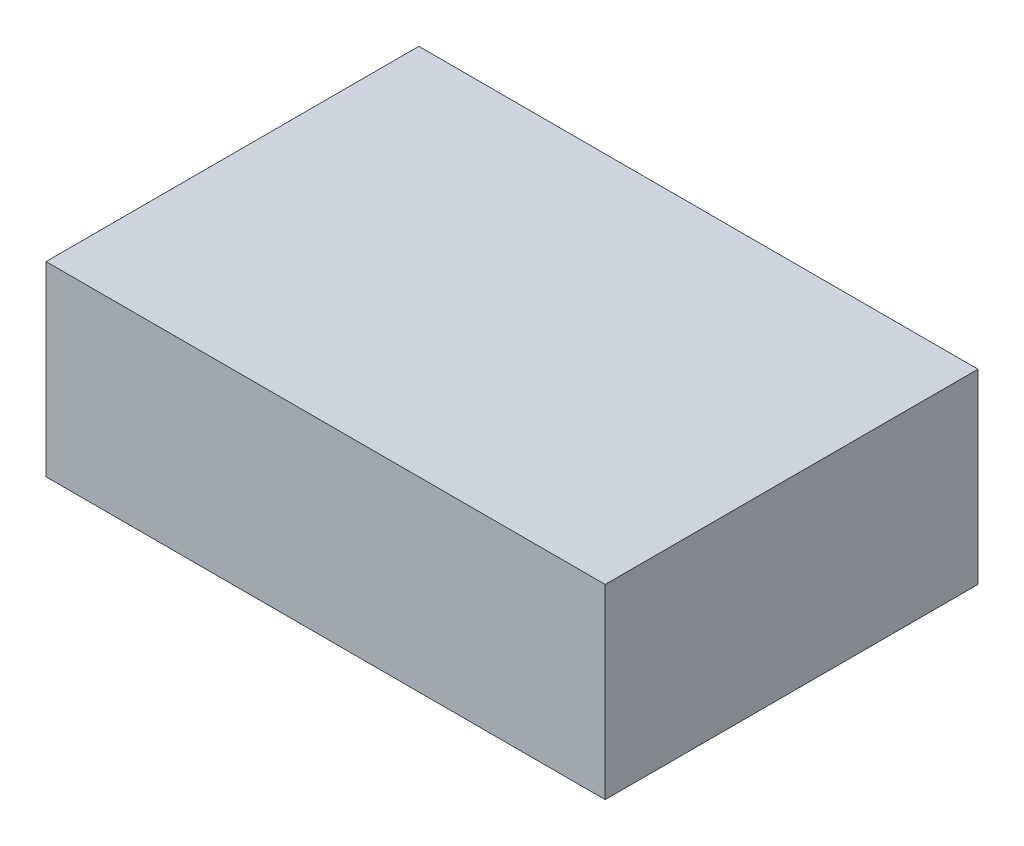
ISO-10303-21;
HEADER;
FILE_DESCRIPTION(('STEP AP214'),'2;1');
FILE_NAME('part.step','',(''),(''),'','','');
FILE_SCHEMA(('AUTOMOTIVE_DESIGN { 1 0 10303 214 1 1 1 1 }'));
ENDSEC;
DATA;
#1=APPLICATION_CONTEXT('core data for automotive mechanical design processes');
#2=APPLICATION_PROTOCOL_DEFINITION('international standard','automotive_design',2000,#1);
#3=PRODUCT_CONTEXT('',#1,'mechanical');
#4=PRODUCT('Part','Part','',(#3));
#5=PRODUCT_RELATED_PRODUCT_CATEGORY('part','',(#4));
#6=PRODUCT_DEFINITION_FORMATION('','',#4);
#7=PRODUCT_DEFINITION_CONTEXT('part definition',#1,'design');
#8=PRODUCT_DEFINITION('design','',#6,#7);
#9=PRODUCT_DEFINITION_SHAPE('','',#8);
#10=(LENGTH_UNIT() NAMED_UNIT(*) SI_UNIT(.MILLI.,.METRE.));
#11=(NAMED_UNIT(*) PLANE_ANGLE_UNIT() SI_UNIT($,.RADIAN.));
#12=(NAMED_UNIT(*) SI_UNIT($,.STERADIAN.) SOLID_ANGLE_UNIT());
#13=UNCERTAINTY_MEASURE_WITH_UNIT(LENGTH_MEASURE(1.E-05),#10,'distance_accuracy_value','');
#14=(GEOMETRIC_REPRESENTATION_CONTEXT(3) GLOBAL_UNCERTAINTY_ASSIGNED_CONTEXT((#13)) GLOBAL_UNIT_ASSIGNED_CONTEXT((#10,
#11,#12)) REPRESENTATION_CONTEXT('',''));
#15=CARTESIAN_POINT('',(0.,0.,0.));
#16=DIRECTION('',(0.,0.,1.));
#17=DIRECTION('',(1.,0.,0.));
#18=AXIS2_PLACEMENT_3D('',#15,#16,#17);
#19=CARTESIAN_POINT('',(45.,30.,30.));
#20=DIRECTION('',(-1.,0.,0.));
#21=DIRECTION('',(0.,0.,1.));
#22=AXIS2_PLACEMENT_3D('',#19,#20,#21);
#23=PLANE('',#22);
#24=DIRECTION('',(0.,0.,-1.));
#25=VECTOR('',#24,1.);
#26=CARTESIAN_POINT('',(45.,0.,30.));
#27=LINE('',#26,#25);
#28=CARTESIAN_POINT('',(45.,0.,30.));
#29=VERTEX_POINT('',#28);
#30=CARTESIAN_POINT('',(45.,0.,-30.));
#31=VERTEX_POINT('',#30);
#32=EDGE_CURVE('E96',#29,#31,#27,.T.);
#33=ORIENTED_EDGE('',*,*,#32,.T.);
#34=DIRECTION('',(0.,-1.,0.));
#35=VECTOR('',#34,1.);
#36=CARTESIAN_POINT('',(45.,30.,-30.));
#37=LINE('',#36,#35);
#38=CARTESIAN_POINT('',(45.,30.,-30.));
#39=VERTEX_POINT('',#38);
#40=EDGE_CURVE('E11',#39,#31,#37,.T.);
#41=ORIENTED_EDGE('',*,*,#40,.F.);
#42=DIRECTION('',(0.,0.,-1.));
#43=VECTOR('',#42,1.);
#44=CARTESIAN_POINT('',(45.,30.,30.));
#45=LINE('',#44,#43);
#46=CARTESIAN_POINT('',(45.,30.,30.));
#47=VERTEX_POINT('',#46);
#48=EDGE_CURVE('E84',#47,#39,#45,.T.);
#49=ORIENTED_EDGE('',*,*,#48,.F.);
#50=DIRECTION('',(0.,-1.,0.));
#51=VECTOR('',#50,1.);
#52=CARTESIAN_POINT('',(45.,30.,30.));
#53=LINE('',#52,#51);
#54=EDGE_CURVE('E92',#47,#29,#53,.T.);
#55=ORIENTED_EDGE('',*,*,#54,.T.);
#56=EDGE_LOOP('',(#33,#41,#49,#55));
#57=FACE_BOUND('',#56,.T.);
#58=ADVANCED_FACE('F33',(#57),#23,.F.);
#59=CARTESIAN_POINT('',(-45.,30.,-30.));
#60=DIRECTION('',(0.,0.,1.));
#61=DIRECTION('',(1.,0.,0.));
#62=AXIS2_PLACEMENT_3D('',#59,#60,#61);
#63=PLANE('',#62);
#64=DIRECTION('',(-1.,0.,0.));
#65=VECTOR('',#64,1.);
#66=CARTESIAN_POINT('',(-45.,0.,-30.));
#67=LINE('',#66,#65);
#68=CARTESIAN_POINT('',(-45.,0.,-30.));
#69=VERTEX_POINT('',#68);
#70=EDGE_CURVE('E88',#31,#69,#67,.T.);
#71=ORIENTED_EDGE('',*,*,#70,.T.);
#72=DIRECTION('',(0.,-1.,0.));
#73=VECTOR('',#72,1.);
#74=CARTESIAN_POINT('',(-45.,30.,-30.));
#75=LINE('',#74,#73);
#76=CARTESIAN_POINT('',(-45.,30.,-30.));
#77=VERTEX_POINT('',#76);
#78=EDGE_CURVE('E41',#77,#69,#75,.T.);
#79=ORIENTED_EDGE('',*,*,#78,.F.);
#80=DIRECTION('',(-1.,0.,0.));
#81=VECTOR('',#80,1.);
#82=CARTESIAN_POINT('',(-45.,30.,-30.));
#83=LINE('',#82,#81);
#84=EDGE_CURVE('E79',#39,#77,#83,.T.);
#85=ORIENTED_EDGE('',*,*,#84,.F.);
#86=ORIENTED_EDGE('',*,*,#40,.T.);
#87=EDGE_LOOP('',(#71,#79,#85,#86));
#88=FACE_BOUND('',#87,.T.);
#89=ADVANCED_FACE('F87',(#88),#63,.F.);
#90=CARTESIAN_POINT('',(-45.,30.,30.));
#91=DIRECTION('',(1.,0.,0.));
#92=DIRECTION('',(0.,0.,-1.));
#93=AXIS2_PLACEMENT_3D('',#90,#91,#92);
#94=PLANE('',#93);
#95=DIRECTION('',(0.,0.,1.));
#96=VECTOR('',#95,1.);
#97=CARTESIAN_POINT('',(-45.,0.,30.));
#98=LINE('',#97,#96);
#99=CARTESIAN_POINT('',(-45.,0.,30.));
#100=VERTEX_POINT('',#99);
#101=EDGE_CURVE('E66',#69,#100,#98,.T.);
#102=ORIENTED_EDGE('',*,*,#101,.T.);
#103=DIRECTION('',(0.,-1.,0.));
#104=VECTOR('',#103,1.);
#105=CARTESIAN_POINT('',(-45.,30.,30.));
#106=LINE('',#105,#104);
#107=CARTESIAN_POINT('',(-45.,30.,30.));
#108=VERTEX_POINT('',#107);
#109=EDGE_CURVE('E89',#108,#100,#106,.T.);
#110=ORIENTED_EDGE('',*,*,#109,.F.);
#111=DIRECTION('',(0.,0.,1.));
#112=VECTOR('',#111,1.);
#113=CARTESIAN_POINT('',(-45.,30.,30.));
#114=LINE('',#113,#112);
#115=EDGE_CURVE('E82',#77,#108,#114,.T.);
#116=ORIENTED_EDGE('',*,*,#115,.F.);
#117=ORIENTED_EDGE('',*,*,#78,.T.);
#118=EDGE_LOOP('',(#102,#110,#116,#117));
#119=FACE_BOUND('',#118,.T.);
#120=ADVANCED_FACE('F90',(#119),#94,.F.);
#121=CARTESIAN_POINT('',(-45.,30.,30.));
#122=DIRECTION('',(0.,0.,-1.));
#123=DIRECTION('',(-1.,0.,0.));
#124=AXIS2_PLACEMENT_3D('',#121,#122,#123);
#125=PLANE('',#124);
#126=DIRECTION('',(1.,0.,0.));
#127=VECTOR('',#126,1.);
#128=CARTESIAN_POINT('',(-45.,0.,30.));
#129=LINE('',#128,#127);
#130=EDGE_CURVE('E72',#100,#29,#129,.T.);
#131=ORIENTED_EDGE('',*,*,#130,.T.);
#132=ORIENTED_EDGE('',*,*,#54,.F.);
#133=DIRECTION('',(1.,0.,0.));
#134=VECTOR('',#133,1.);
#135=CARTESIAN_POINT('',(-45.,30.,30.));
#136=LINE('',#135,#134);
#137=EDGE_CURVE('E49',#108,#47,#136,.T.);
#138=ORIENTED_EDGE('',*,*,#137,.F.);
#139=ORIENTED_EDGE('',*,*,#109,.T.);
#140=EDGE_LOOP('',(#131,#132,#138,#139));
#141=FACE_BOUND('',#140,.T.);
#142=ADVANCED_FACE('F103',(#141),#125,.F.);
#143=CARTESIAN_POINT('',(0.,30.,0.));
#144=DIRECTION('',(0.,-1.,0.));
#145=DIRECTION('',(0.,0.,-1.));
#146=AXIS2_PLACEMENT_3D('',#143,#144,#145);
#147=PLANE('',#146);
#148=ORIENTED_EDGE('',*,*,#48,.T.);
#149=ORIENTED_EDGE('',*,*,#84,.T.);
#150=ORIENTED_EDGE('',*,*,#115,.T.);
#151=ORIENTED_EDGE('',*,*,#137,.T.);
#152=EDGE_LOOP('',(#148,#149,#150,#151));
#153=FACE_BOUND('',#152,.T.);
#154=ADVANCED_FACE('F80',(#153),#147,.F.);
#155=CARTESIAN_POINT('',(0.,0.,0.));
#156=DIRECTION('',(0.,-1.,0.));
#157=DIRECTION('',(0.,0.,-1.));
#158=AXIS2_PLACEMENT_3D('',#155,#156,#157);
#159=PLANE('',#158);
#160=ORIENTED_EDGE('',*,*,#32,.F.);
#161=ORIENTED_EDGE('',*,*,#130,.F.);
#162=ORIENTED_EDGE('',*,*,#101,.F.);
#163=ORIENTED_EDGE('',*,*,#70,.F.);
#164=EDGE_LOOP('',(#160,#161,#162,#163));
#165=FACE_BOUND('',#164,.T.);
#166=ADVANCED_FACE('F106',(#165),#159,.T.);
#167=CLOSED_SHELL('',(#58,#89,#120,#142,#154,#166));
#168=MANIFOLD_SOLID_BREP('B2',#167);
#169=ADVANCED_BREP_SHAPE_REPRESENTATION('',(#18,#168),#14);
#170=SHAPE_DEFINITION_REPRESENTATION(#9,#169);
ENDSEC;
END-ISO-10303-21;
